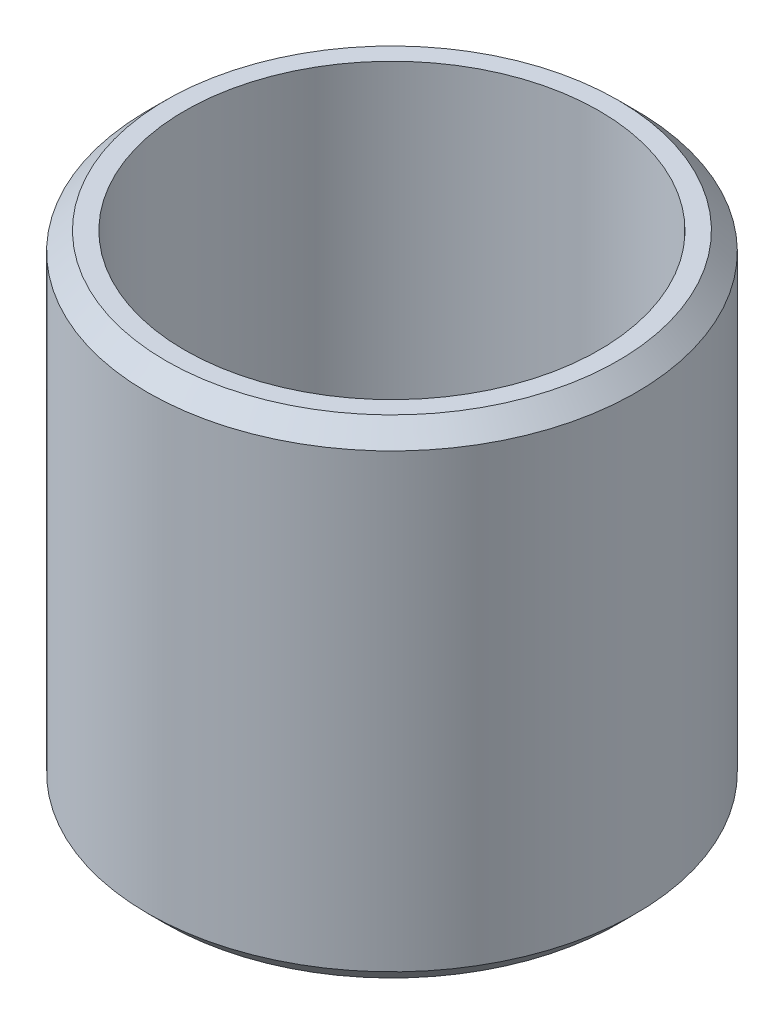
ISO-10303-21;
HEADER;
FILE_DESCRIPTION(('STEP AP214'),'2;1');
FILE_NAME('part.step','',(''),(''),'','','');
FILE_SCHEMA(('AUTOMOTIVE_DESIGN { 1 0 10303 214 1 1 1 1 }'));
ENDSEC;
DATA;
#1=APPLICATION_CONTEXT('core data for automotive mechanical design processes');
#2=APPLICATION_PROTOCOL_DEFINITION('international standard','automotive_design',2000,#1);
#3=PRODUCT_CONTEXT('',#1,'mechanical');
#4=PRODUCT('Part','Part','',(#3));
#5=PRODUCT_RELATED_PRODUCT_CATEGORY('part','',(#4));
#6=PRODUCT_DEFINITION_FORMATION('','',#4);
#7=PRODUCT_DEFINITION_CONTEXT('part definition',#1,'design');
#8=PRODUCT_DEFINITION('design','',#6,#7);
#9=PRODUCT_DEFINITION_SHAPE('','',#8);
#10=(LENGTH_UNIT() NAMED_UNIT(*) SI_UNIT(.MILLI.,.METRE.));
#11=(NAMED_UNIT(*) PLANE_ANGLE_UNIT() SI_UNIT($,.RADIAN.));
#12=(NAMED_UNIT(*) SI_UNIT($,.STERADIAN.) SOLID_ANGLE_UNIT());
#13=UNCERTAINTY_MEASURE_WITH_UNIT(LENGTH_MEASURE(1.E-05),#10,'distance_accuracy_value','');
#14=(GEOMETRIC_REPRESENTATION_CONTEXT(3) GLOBAL_UNCERTAINTY_ASSIGNED_CONTEXT((#13)) GLOBAL_UNIT_ASSIGNED_CONTEXT((#10,
#11,#12)) REPRESENTATION_CONTEXT('',''));
#15=CARTESIAN_POINT('',(0.,0.,0.));
#16=DIRECTION('',(0.,0.,1.));
#17=DIRECTION('',(1.,0.,0.));
#18=AXIS2_PLACEMENT_3D('',#15,#16,#17);
#19=CARTESIAN_POINT('',(0.,20.,0.));
#20=DIRECTION('',(0.,1.,0.));
#21=DIRECTION('',(0.,0.,1.));
#22=AXIS2_PLACEMENT_3D('',#19,#20,#21);
#23=PLANE('',#22);
#24=CARTESIAN_POINT('',(0.,20.,0.));
#25=DIRECTION('',(0.,1.,0.));
#26=DIRECTION('',(0.,0.,1.));
#27=AXIS2_PLACEMENT_3D('',#24,#25,#26);
#28=CIRCLE('',#27,18.532);
#29=CARTESIAN_POINT('',(0.,20.,18.532));
#30=VERTEX_POINT('',#29);
#31=EDGE_CURVE('E10',#30,#30,#28,.T.);
#32=ORIENTED_EDGE('',*,*,#31,.T.);
#33=EDGE_LOOP('',(#32));
#34=FACE_BOUND('',#33,.T.);
#35=CARTESIAN_POINT('',(0.,20.,0.));
#36=DIRECTION('',(0.,1.,0.));
#37=DIRECTION('',(0.,0.,1.));
#38=AXIS2_PLACEMENT_3D('',#35,#36,#37);
#39=CIRCLE('',#38,17.);
#40=CARTESIAN_POINT('',(0.,20.,17.));
#41=VERTEX_POINT('',#40);
#42=EDGE_CURVE('E55',#41,#41,#39,.T.);
#43=ORIENTED_EDGE('',*,*,#42,.F.);
#44=EDGE_LOOP('',(#43));
#45=FACE_BOUND('',#44,.T.);
#46=ADVANCED_FACE('F35',(#34,#45),#23,.T.);
#47=CARTESIAN_POINT('',(0.,-20.,0.));
#48=DIRECTION('',(0.,1.,0.));
#49=DIRECTION('',(0.,0.,1.));
#50=AXIS2_PLACEMENT_3D('',#47,#48,#49);
#51=PLANE('',#50);
#52=CARTESIAN_POINT('',(0.,-20.,0.));
#53=DIRECTION('',(0.,1.,0.));
#54=DIRECTION('',(0.,0.,1.));
#55=AXIS2_PLACEMENT_3D('',#52,#53,#54);
#56=CIRCLE('',#55,18.532);
#57=CARTESIAN_POINT('',(0.,-20.,18.532));
#58=VERTEX_POINT('',#57);
#59=EDGE_CURVE('E42',#58,#58,#56,.F.);
#60=ORIENTED_EDGE('',*,*,#59,.T.);
#61=EDGE_LOOP('',(#60));
#62=FACE_BOUND('',#61,.T.);
#63=CARTESIAN_POINT('',(0.,-20.,0.));
#64=DIRECTION('',(0.,1.,0.));
#65=DIRECTION('',(0.,0.,1.));
#66=AXIS2_PLACEMENT_3D('',#63,#64,#65);
#67=CIRCLE('',#66,17.);
#68=CARTESIAN_POINT('',(0.,-20.,17.));
#69=VERTEX_POINT('',#68);
#70=EDGE_CURVE('E58',#69,#69,#67,.T.);
#71=ORIENTED_EDGE('',*,*,#70,.T.);
#72=EDGE_LOOP('',(#71));
#73=FACE_BOUND('',#72,.T.);
#74=ADVANCED_FACE('F62',(#62,#73),#51,.F.);
#75=CARTESIAN_POINT('',(0.,20.,0.));
#76=DIRECTION('',(0.,-1.,0.));
#77=DIRECTION('',(0.,0.,-1.));
#78=AXIS2_PLACEMENT_3D('',#75,#76,#77);
#79=CYLINDRICAL_SURFACE('',#78,20.032);
#80=CARTESIAN_POINT('',(0.,-18.5,0.));
#81=DIRECTION('',(0.,1.,0.));
#82=DIRECTION('',(0.,0.,1.));
#83=AXIS2_PLACEMENT_3D('',#80,#81,#82);
#84=CIRCLE('',#83,20.032);
#85=CARTESIAN_POINT('',(0.,-18.5,20.032));
#86=VERTEX_POINT('',#85);
#87=EDGE_CURVE('E46',#86,#86,#84,.T.);
#88=ORIENTED_EDGE('',*,*,#87,.T.);
#89=EDGE_LOOP('',(#88));
#90=FACE_BOUND('',#89,.T.);
#91=CARTESIAN_POINT('',(0.,18.5,0.));
#92=DIRECTION('',(0.,1.,0.));
#93=DIRECTION('',(0.,0.,1.));
#94=AXIS2_PLACEMENT_3D('',#91,#92,#93);
#95=CIRCLE('',#94,20.032);
#96=CARTESIAN_POINT('',(0.,18.5,20.032));
#97=VERTEX_POINT('',#96);
#98=EDGE_CURVE('E50',#97,#97,#95,.F.);
#99=ORIENTED_EDGE('',*,*,#98,.T.);
#100=EDGE_LOOP('',(#99));
#101=FACE_BOUND('',#100,.T.);
#102=ADVANCED_FACE('F37',(#90,#101),#79,.T.);
#103=CARTESIAN_POINT('',(0.,20.,0.));
#104=DIRECTION('',(0.,-1.,0.));
#105=DIRECTION('',(0.,0.,-1.));
#106=AXIS2_PLACEMENT_3D('',#103,#104,#105);
#107=CYLINDRICAL_SURFACE('',#106,17.);
#108=ORIENTED_EDGE('',*,*,#42,.T.);
#109=EDGE_LOOP('',(#108));
#110=FACE_BOUND('',#109,.T.);
#111=ORIENTED_EDGE('',*,*,#70,.F.);
#112=EDGE_LOOP('',(#111));
#113=FACE_BOUND('',#112,.T.);
#114=ADVANCED_FACE('F64',(#110,#113),#107,.F.);
#115=CARTESIAN_POINT('',(0.,-18.5,0.));
#116=DIRECTION('',(0.,1.,0.));
#117=DIRECTION('',(0.,0.,1.));
#118=AXIS2_PLACEMENT_3D('',#115,#116,#117);
#119=CONICAL_SURFACE('',#118,20.032,0.785398163397447);
#120=ORIENTED_EDGE('',*,*,#59,.F.);
#121=EDGE_LOOP('',(#120));
#122=FACE_BOUND('',#121,.T.);
#123=ORIENTED_EDGE('',*,*,#87,.F.);
#124=EDGE_LOOP('',(#123));
#125=FACE_BOUND('',#124,.T.);
#126=ADVANCED_FACE('F66',(#122,#125),#119,.T.);
#127=CARTESIAN_POINT('',(0.,20.,0.));
#128=DIRECTION('',(0.,-1.,0.));
#129=DIRECTION('',(0.,0.,-1.));
#130=AXIS2_PLACEMENT_3D('',#127,#128,#129);
#131=CONICAL_SURFACE('',#130,18.532,0.785398163397447);
#132=ORIENTED_EDGE('',*,*,#98,.F.);
#133=EDGE_LOOP('',(#132));
#134=FACE_BOUND('',#133,.T.);
#135=ORIENTED_EDGE('',*,*,#31,.F.);
#136=EDGE_LOOP('',(#135));
#137=FACE_BOUND('',#136,.T.);
#138=ADVANCED_FACE('F73',(#134,#137),#131,.T.);
#139=CLOSED_SHELL('',(#46,#74,#102,#114,#126,#138));
#140=MANIFOLD_SOLID_BREP('B2',#139);
#141=ADVANCED_BREP_SHAPE_REPRESENTATION('',(#18,#140),#14);
#142=SHAPE_DEFINITION_REPRESENTATION(#9,#141);
ENDSEC;
END-ISO-10303-21;
